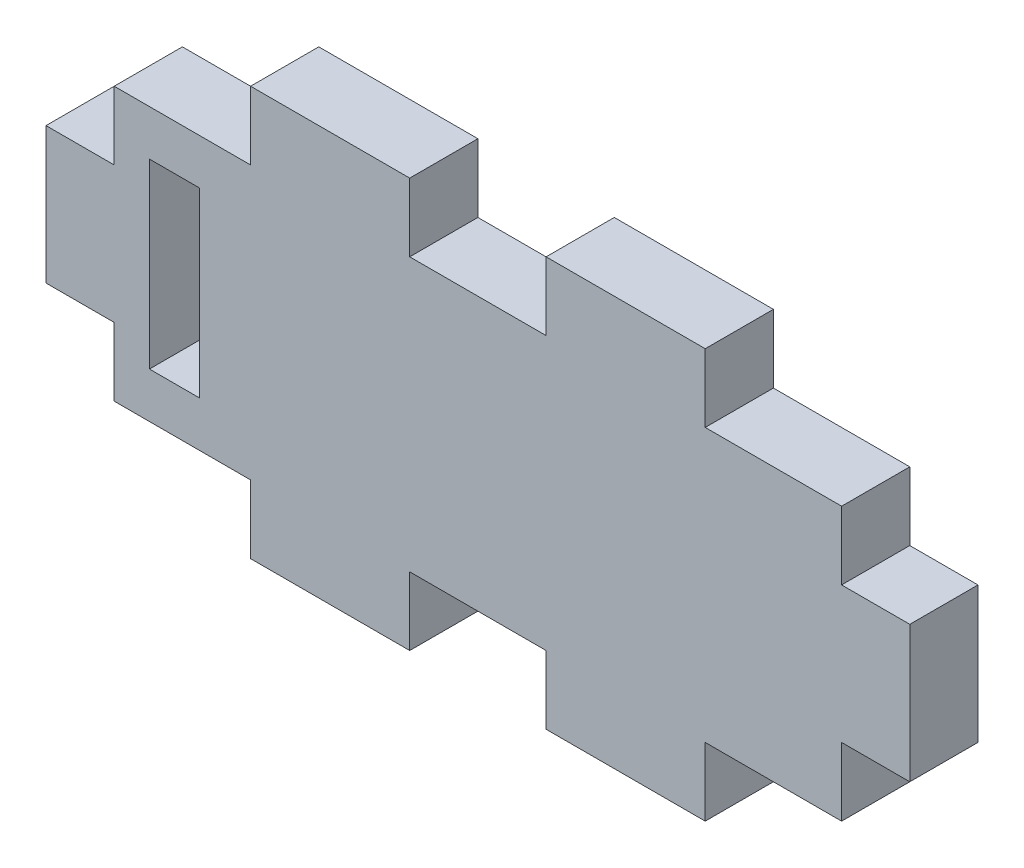
ISO-10303-21;
HEADER;
FILE_DESCRIPTION(('STEP AP214'),'2;1');
FILE_NAME('part.step','',(''),(''),'','','');
FILE_SCHEMA(('AUTOMOTIVE_DESIGN { 1 0 10303 214 1 1 1 1 }'));
ENDSEC;
DATA;
#1=APPLICATION_CONTEXT('core data for automotive mechanical design processes');
#2=APPLICATION_PROTOCOL_DEFINITION('international standard','automotive_design',2000,#1);
#3=PRODUCT_CONTEXT('',#1,'mechanical');
#4=PRODUCT('Part','Part','',(#3));
#5=PRODUCT_RELATED_PRODUCT_CATEGORY('part','',(#4));
#6=PRODUCT_DEFINITION_FORMATION('','',#4);
#7=PRODUCT_DEFINITION_CONTEXT('part definition',#1,'design');
#8=PRODUCT_DEFINITION('design','',#6,#7);
#9=PRODUCT_DEFINITION_SHAPE('','',#8);
#10=(LENGTH_UNIT() NAMED_UNIT(*) SI_UNIT(.MILLI.,.METRE.));
#11=(NAMED_UNIT(*) PLANE_ANGLE_UNIT() SI_UNIT($,.RADIAN.));
#12=(NAMED_UNIT(*) SI_UNIT($,.STERADIAN.) SOLID_ANGLE_UNIT());
#13=UNCERTAINTY_MEASURE_WITH_UNIT(LENGTH_MEASURE(1.E-05),#10,'distance_accuracy_value','');
#14=(GEOMETRIC_REPRESENTATION_CONTEXT(3) GLOBAL_UNCERTAINTY_ASSIGNED_CONTEXT((#13)) GLOBAL_UNIT_ASSIGNED_CONTEXT((#10,
#11,#12)) REPRESENTATION_CONTEXT('',''));
#15=CARTESIAN_POINT('',(0.,0.,0.));
#16=DIRECTION('',(0.,0.,1.));
#17=DIRECTION('',(1.,0.,0.));
#18=AXIS2_PLACEMENT_3D('',#15,#16,#17);
#19=CARTESIAN_POINT('',(-16.,6.,3.));
#20=DIRECTION('',(1.,0.,0.));
#21=DIRECTION('',(0.,1.,0.));
#22=AXIS2_PLACEMENT_3D('',#19,#20,#21);
#23=PLANE('',#22);
#24=DIRECTION('',(0.,0.,1.));
#25=VECTOR('',#24,1.);
#26=CARTESIAN_POINT('',(-16.,-3.,0.));
#27=LINE('',#26,#25);
#28=CARTESIAN_POINT('',(-16.,-3.,0.));
#29=VERTEX_POINT('',#28);
#30=CARTESIAN_POINT('',(-16.,-3.,3.));
#31=VERTEX_POINT('',#30);
#32=EDGE_CURVE('E424',#29,#31,#27,.T.);
#33=ORIENTED_EDGE('',*,*,#32,.F.);
#34=DIRECTION('',(0.,-1.,0.));
#35=VECTOR('',#34,1.);
#36=CARTESIAN_POINT('',(-16.,6.,0.));
#37=LINE('',#36,#35);
#38=CARTESIAN_POINT('',(-16.,-6.,0.));
#39=VERTEX_POINT('',#38);
#40=EDGE_CURVE('E509',#29,#39,#37,.T.);
#41=ORIENTED_EDGE('',*,*,#40,.T.);
#42=DIRECTION('',(0.,0.,-1.));
#43=VECTOR('',#42,1.);
#44=CARTESIAN_POINT('',(-16.,-6.,3.));
#45=LINE('',#44,#43);
#46=CARTESIAN_POINT('',(-16.,-6.,3.));
#47=VERTEX_POINT('',#46);
#48=EDGE_CURVE('E11',#47,#39,#45,.T.);
#49=ORIENTED_EDGE('',*,*,#48,.F.);
#50=DIRECTION('',(0.,-1.,0.));
#51=VECTOR('',#50,1.);
#52=CARTESIAN_POINT('',(-16.,6.,3.));
#53=LINE('',#52,#51);
#54=EDGE_CURVE('E524',#31,#47,#53,.T.);
#55=ORIENTED_EDGE('',*,*,#54,.F.);
#56=EDGE_LOOP('',(#33,#41,#49,#55));
#57=FACE_BOUND('',#56,.T.);
#58=ADVANCED_FACE('F44',(#57),#23,.F.);
#59=CARTESIAN_POINT('',(-16.,-6.,3.));
#60=DIRECTION('',(0.,1.,0.));
#61=DIRECTION('',(0.,0.,1.));
#62=AXIS2_PLACEMENT_3D('',#59,#60,#61);
#63=PLANE('',#62);
#64=DIRECTION('',(0.,0.,1.));
#65=VECTOR('',#64,1.);
#66=CARTESIAN_POINT('',(10.,-6.,0.));
#67=LINE('',#66,#65);
#68=CARTESIAN_POINT('',(10.,-6.,0.));
#69=VERTEX_POINT('',#68);
#70=CARTESIAN_POINT('',(10.,-6.,3.));
#71=VERTEX_POINT('',#70);
#72=EDGE_CURVE('E314',#69,#71,#67,.T.);
#73=ORIENTED_EDGE('',*,*,#72,.F.);
#74=DIRECTION('',(1.,0.,0.));
#75=VECTOR('',#74,1.);
#76=CARTESIAN_POINT('',(-16.,-6.,0.));
#77=LINE('',#76,#75);
#78=CARTESIAN_POINT('',(16.,-6.,0.));
#79=VERTEX_POINT('',#78);
#80=EDGE_CURVE('E546',#69,#79,#77,.T.);
#81=ORIENTED_EDGE('',*,*,#80,.T.);
#82=DIRECTION('',(0.,0.,-1.));
#83=VECTOR('',#82,1.);
#84=CARTESIAN_POINT('',(16.,-6.,3.));
#85=LINE('',#84,#83);
#86=CARTESIAN_POINT('',(16.,-6.,3.));
#87=VERTEX_POINT('',#86);
#88=EDGE_CURVE('E53',#87,#79,#85,.T.);
#89=ORIENTED_EDGE('',*,*,#88,.F.);
#90=DIRECTION('',(1.,0.,0.));
#91=VECTOR('',#90,1.);
#92=CARTESIAN_POINT('',(-16.,-6.,3.));
#93=LINE('',#92,#91);
#94=EDGE_CURVE('E523',#71,#87,#93,.T.);
#95=ORIENTED_EDGE('',*,*,#94,.F.);
#96=EDGE_LOOP('',(#73,#81,#89,#95));
#97=FACE_BOUND('',#96,.T.);
#98=ADVANCED_FACE('F611',(#97),#63,.F.);
#99=CARTESIAN_POINT('',(-3.,-6.,0.));
#100=VERTEX_POINT('',#99);
#101=CARTESIAN_POINT('',(3.,-6.,0.));
#102=VERTEX_POINT('',#101);
#103=EDGE_CURVE('E552',#100,#102,#77,.T.);
#104=ORIENTED_EDGE('',*,*,#103,.T.);
#105=DIRECTION('',(0.,0.,1.));
#106=VECTOR('',#105,1.);
#107=CARTESIAN_POINT('',(3.,-6.,0.));
#108=LINE('',#107,#106);
#109=CARTESIAN_POINT('',(3.,-6.,3.));
#110=VERTEX_POINT('',#109);
#111=EDGE_CURVE('E303',#102,#110,#108,.T.);
#112=ORIENTED_EDGE('',*,*,#111,.T.);
#113=CARTESIAN_POINT('',(-3.,-6.,3.));
#114=VERTEX_POINT('',#113);
#115=EDGE_CURVE('E530',#114,#110,#93,.T.);
#116=ORIENTED_EDGE('',*,*,#115,.F.);
#117=DIRECTION('',(0.,0.,1.));
#118=VECTOR('',#117,1.);
#119=CARTESIAN_POINT('',(-3.,-6.,0.));
#120=LINE('',#119,#118);
#121=EDGE_CURVE('E495',#100,#114,#120,.T.);
#122=ORIENTED_EDGE('',*,*,#121,.F.);
#123=EDGE_LOOP('',(#104,#112,#116,#122));
#124=FACE_BOUND('',#123,.T.);
#125=ADVANCED_FACE('F599',(#124),#63,.F.);
#126=CARTESIAN_POINT('',(16.,6.,3.));
#127=DIRECTION('',(-1.,0.,0.));
#128=DIRECTION('',(0.,0.,1.));
#129=AXIS2_PLACEMENT_3D('',#126,#127,#128);
#130=PLANE('',#129);
#131=DIRECTION('',(0.,0.,1.));
#132=VECTOR('',#131,1.);
#133=CARTESIAN_POINT('',(16.,3.,0.));
#134=LINE('',#133,#132);
#135=CARTESIAN_POINT('',(16.,3.,0.));
#136=VERTEX_POINT('',#135);
#137=CARTESIAN_POINT('',(16.,3.,3.));
#138=VERTEX_POINT('',#137);
#139=EDGE_CURVE('E449',#136,#138,#134,.T.);
#140=ORIENTED_EDGE('',*,*,#139,.F.);
#141=DIRECTION('',(0.,1.,0.));
#142=VECTOR('',#141,1.);
#143=CARTESIAN_POINT('',(16.,6.,0.));
#144=LINE('',#143,#142);
#145=CARTESIAN_POINT('',(16.,6.,0.));
#146=VERTEX_POINT('',#145);
#147=EDGE_CURVE('E551',#136,#146,#144,.T.);
#148=ORIENTED_EDGE('',*,*,#147,.T.);
#149=DIRECTION('',(0.,0.,-1.));
#150=VECTOR('',#149,1.);
#151=CARTESIAN_POINT('',(16.,6.,3.));
#152=LINE('',#151,#150);
#153=CARTESIAN_POINT('',(16.,6.,3.));
#154=VERTEX_POINT('',#153);
#155=EDGE_CURVE('E566',#154,#146,#152,.T.);
#156=ORIENTED_EDGE('',*,*,#155,.F.);
#157=DIRECTION('',(0.,1.,0.));
#158=VECTOR('',#157,1.);
#159=CARTESIAN_POINT('',(16.,6.,3.));
#160=LINE('',#159,#158);
#161=EDGE_CURVE('E529',#138,#154,#160,.T.);
#162=ORIENTED_EDGE('',*,*,#161,.F.);
#163=EDGE_LOOP('',(#140,#148,#156,#162));
#164=FACE_BOUND('',#163,.T.);
#165=ADVANCED_FACE('F701',(#164),#130,.F.);
#166=CARTESIAN_POINT('',(-16.,6.,3.));
#167=DIRECTION('',(0.,-1.,0.));
#168=DIRECTION('',(0.,0.,-1.));
#169=AXIS2_PLACEMENT_3D('',#166,#167,#168);
#170=PLANE('',#169);
#171=DIRECTION('',(0.,0.,1.));
#172=VECTOR('',#171,1.);
#173=CARTESIAN_POINT('',(-10.,6.,0.));
#174=LINE('',#173,#172);
#175=CARTESIAN_POINT('',(-10.,6.,0.));
#176=VERTEX_POINT('',#175);
#177=CARTESIAN_POINT('',(-10.,6.,3.));
#178=VERTEX_POINT('',#177);
#179=EDGE_CURVE('E388',#176,#178,#174,.T.);
#180=ORIENTED_EDGE('',*,*,#179,.F.);
#181=DIRECTION('',(-1.,0.,0.));
#182=VECTOR('',#181,1.);
#183=CARTESIAN_POINT('',(-16.,6.,0.));
#184=LINE('',#183,#182);
#185=CARTESIAN_POINT('',(-16.,6.,0.));
#186=VERTEX_POINT('',#185);
#187=EDGE_CURVE('E557',#176,#186,#184,.T.);
#188=ORIENTED_EDGE('',*,*,#187,.T.);
#189=DIRECTION('',(0.,0.,-1.));
#190=VECTOR('',#189,1.);
#191=CARTESIAN_POINT('',(-16.,6.,3.));
#192=LINE('',#191,#190);
#193=CARTESIAN_POINT('',(-16.,6.,3.));
#194=VERTEX_POINT('',#193);
#195=EDGE_CURVE('E540',#194,#186,#192,.T.);
#196=ORIENTED_EDGE('',*,*,#195,.F.);
#197=DIRECTION('',(-1.,0.,0.));
#198=VECTOR('',#197,1.);
#199=CARTESIAN_POINT('',(-16.,6.,3.));
#200=LINE('',#199,#198);
#201=EDGE_CURVE('E535',#178,#194,#200,.T.);
#202=ORIENTED_EDGE('',*,*,#201,.F.);
#203=EDGE_LOOP('',(#180,#188,#196,#202));
#204=FACE_BOUND('',#203,.T.);
#205=ADVANCED_FACE('F662',(#204),#170,.F.);
#206=CARTESIAN_POINT('',(3.,6.,0.));
#207=VERTEX_POINT('',#206);
#208=CARTESIAN_POINT('',(-3.,6.,0.));
#209=VERTEX_POINT('',#208);
#210=EDGE_CURVE('E562',#207,#209,#184,.T.);
#211=ORIENTED_EDGE('',*,*,#210,.T.);
#212=DIRECTION('',(0.,0.,1.));
#213=VECTOR('',#212,1.);
#214=CARTESIAN_POINT('',(-3.,6.,0.));
#215=LINE('',#214,#213);
#216=CARTESIAN_POINT('',(-3.,6.,3.));
#217=VERTEX_POINT('',#216);
#218=EDGE_CURVE('E377',#209,#217,#215,.T.);
#219=ORIENTED_EDGE('',*,*,#218,.T.);
#220=CARTESIAN_POINT('',(3.,6.,3.));
#221=VERTEX_POINT('',#220);
#222=EDGE_CURVE('E541',#221,#217,#200,.T.);
#223=ORIENTED_EDGE('',*,*,#222,.F.);
#224=DIRECTION('',(0.,0.,1.));
#225=VECTOR('',#224,1.);
#226=CARTESIAN_POINT('',(3.,6.,0.));
#227=LINE('',#226,#225);
#228=EDGE_CURVE('E341',#207,#221,#227,.T.);
#229=ORIENTED_EDGE('',*,*,#228,.F.);
#230=EDGE_LOOP('',(#211,#219,#223,#229));
#231=FACE_BOUND('',#230,.T.);
#232=ADVANCED_FACE('F656',(#231),#170,.F.);
#233=CARTESIAN_POINT('',(-16.,3.,0.));
#234=VERTEX_POINT('',#233);
#235=EDGE_CURVE('E542',#186,#234,#37,.T.);
#236=ORIENTED_EDGE('',*,*,#235,.T.);
#237=DIRECTION('',(0.,0.,1.));
#238=VECTOR('',#237,1.);
#239=CARTESIAN_POINT('',(-16.,3.,0.));
#240=LINE('',#239,#238);
#241=CARTESIAN_POINT('',(-16.,3.,3.));
#242=VERTEX_POINT('',#241);
#243=EDGE_CURVE('E413',#234,#242,#240,.T.);
#244=ORIENTED_EDGE('',*,*,#243,.T.);
#245=EDGE_CURVE('E519',#194,#242,#53,.T.);
#246=ORIENTED_EDGE('',*,*,#245,.F.);
#247=ORIENTED_EDGE('',*,*,#195,.T.);
#248=EDGE_LOOP('',(#236,#244,#246,#247));
#249=FACE_BOUND('',#248,.T.);
#250=ADVANCED_FACE('F46',(#249),#23,.F.);
#251=CARTESIAN_POINT('',(-10.,-6.,0.));
#252=VERTEX_POINT('',#251);
#253=EDGE_CURVE('E547',#39,#252,#77,.T.);
#254=ORIENTED_EDGE('',*,*,#253,.T.);
#255=DIRECTION('',(0.,0.,1.));
#256=VECTOR('',#255,1.);
#257=CARTESIAN_POINT('',(-10.,-6.,0.));
#258=LINE('',#257,#256);
#259=CARTESIAN_POINT('',(-10.,-6.,3.));
#260=VERTEX_POINT('',#259);
#261=EDGE_CURVE('E513',#252,#260,#258,.T.);
#262=ORIENTED_EDGE('',*,*,#261,.T.);
#263=EDGE_CURVE('E525',#47,#260,#93,.T.);
#264=ORIENTED_EDGE('',*,*,#263,.F.);
#265=ORIENTED_EDGE('',*,*,#48,.T.);
#266=EDGE_LOOP('',(#254,#262,#264,#265));
#267=FACE_BOUND('',#266,.T.);
#268=ADVANCED_FACE('F626',(#267),#63,.F.);
#269=CARTESIAN_POINT('',(16.,-3.,0.));
#270=VERTEX_POINT('',#269);
#271=EDGE_CURVE('E553',#79,#270,#144,.T.);
#272=ORIENTED_EDGE('',*,*,#271,.T.);
#273=DIRECTION('',(0.,0.,1.));
#274=VECTOR('',#273,1.);
#275=CARTESIAN_POINT('',(16.,-3.,0.));
#276=LINE('',#275,#274);
#277=CARTESIAN_POINT('',(16.,-3.,3.));
#278=VERTEX_POINT('',#277);
#279=EDGE_CURVE('E453',#270,#278,#276,.T.);
#280=ORIENTED_EDGE('',*,*,#279,.T.);
#281=EDGE_CURVE('E531',#87,#278,#160,.T.);
#282=ORIENTED_EDGE('',*,*,#281,.F.);
#283=ORIENTED_EDGE('',*,*,#88,.T.);
#284=EDGE_LOOP('',(#272,#280,#282,#283));
#285=FACE_BOUND('',#284,.T.);
#286=ADVANCED_FACE('F575',(#285),#130,.F.);
#287=CARTESIAN_POINT('',(10.,6.,0.));
#288=VERTEX_POINT('',#287);
#289=EDGE_CURVE('E558',#146,#288,#184,.T.);
#290=ORIENTED_EDGE('',*,*,#289,.T.);
#291=DIRECTION('',(0.,0.,1.));
#292=VECTOR('',#291,1.);
#293=CARTESIAN_POINT('',(10.,6.,0.));
#294=LINE('',#293,#292);
#295=CARTESIAN_POINT('',(10.,6.,3.));
#296=VERTEX_POINT('',#295);
#297=EDGE_CURVE('E345',#288,#296,#294,.T.);
#298=ORIENTED_EDGE('',*,*,#297,.T.);
#299=EDGE_CURVE('E536',#154,#296,#200,.T.);
#300=ORIENTED_EDGE('',*,*,#299,.F.);
#301=ORIENTED_EDGE('',*,*,#155,.T.);
#302=EDGE_LOOP('',(#290,#298,#300,#301));
#303=FACE_BOUND('',#302,.T.);
#304=ADVANCED_FACE('F665',(#303),#170,.F.);
#305=CARTESIAN_POINT('',(0.,0.,3.));
#306=DIRECTION('',(0.,0.,1.));
#307=DIRECTION('',(1.,0.,0.));
#308=AXIS2_PLACEMENT_3D('',#305,#306,#307);
#309=PLANE('',#308);
#310=DIRECTION('',(0.,1.,0.));
#311=VECTOR('',#310,1.);
#312=CARTESIAN_POINT('',(-12.25,4.,3.));
#313=LINE('',#312,#311);
#314=CARTESIAN_POINT('',(-12.25,-4.,3.));
#315=VERTEX_POINT('',#314);
#316=CARTESIAN_POINT('',(-12.25,4.,3.));
#317=VERTEX_POINT('',#316);
#318=EDGE_CURVE('E60',#315,#317,#313,.T.);
#319=ORIENTED_EDGE('',*,*,#318,.F.);
#320=DIRECTION('',(1.,0.,0.));
#321=VECTOR('',#320,1.);
#322=CARTESIAN_POINT('',(-12.25,-4.,3.));
#323=LINE('',#322,#321);
#324=CARTESIAN_POINT('',(-14.45,-4.,3.));
#325=VERTEX_POINT('',#324);
#326=EDGE_CURVE('E275',#325,#315,#323,.T.);
#327=ORIENTED_EDGE('',*,*,#326,.F.);
#328=DIRECTION('',(0.,-1.,0.));
#329=VECTOR('',#328,1.);
#330=CARTESIAN_POINT('',(-14.45,4.,3.));
#331=LINE('',#330,#329);
#332=CARTESIAN_POINT('',(-14.45,4.,3.));
#333=VERTEX_POINT('',#332);
#334=EDGE_CURVE('E279',#333,#325,#331,.T.);
#335=ORIENTED_EDGE('',*,*,#334,.F.);
#336=DIRECTION('',(-1.,0.,0.));
#337=VECTOR('',#336,1.);
#338=CARTESIAN_POINT('',(-12.25,4.,3.));
#339=LINE('',#338,#337);
#340=EDGE_CURVE('E288',#317,#333,#339,.T.);
#341=ORIENTED_EDGE('',*,*,#340,.F.);
#342=EDGE_LOOP('',(#319,#327,#335,#341));
#343=FACE_BOUND('',#342,.T.);
#344=ORIENTED_EDGE('',*,*,#245,.T.);
#345=DIRECTION('',(-1.,0.,0.));
#346=VECTOR('',#345,1.);
#347=CARTESIAN_POINT('',(-16.,3.,3.));
#348=LINE('',#347,#346);
#349=CARTESIAN_POINT('',(-19.,3.,3.));
#350=VERTEX_POINT('',#349);
#351=EDGE_CURVE('E391',#242,#350,#348,.T.);
#352=ORIENTED_EDGE('',*,*,#351,.T.);
#353=DIRECTION('',(0.,-1.,0.));
#354=VECTOR('',#353,1.);
#355=CARTESIAN_POINT('',(-19.,3.,3.));
#356=LINE('',#355,#354);
#357=CARTESIAN_POINT('',(-19.,-3.,3.));
#358=VERTEX_POINT('',#357);
#359=EDGE_CURVE('E432',#350,#358,#356,.T.);
#360=ORIENTED_EDGE('',*,*,#359,.T.);
#361=DIRECTION('',(1.,0.,0.));
#362=VECTOR('',#361,1.);
#363=CARTESIAN_POINT('',(-16.,-3.,3.));
#364=LINE('',#363,#362);
#365=EDGE_CURVE('E428',#358,#31,#364,.T.);
#366=ORIENTED_EDGE('',*,*,#365,.T.);
#367=ORIENTED_EDGE('',*,*,#54,.T.);
#368=ORIENTED_EDGE('',*,*,#263,.T.);
#369=DIRECTION('',(0.,-1.,0.));
#370=VECTOR('',#369,1.);
#371=CARTESIAN_POINT('',(-10.,-6.,3.));
#372=LINE('',#371,#370);
#373=CARTESIAN_POINT('',(-10.,-9.,3.));
#374=VERTEX_POINT('',#373);
#375=EDGE_CURVE('E499',#260,#374,#372,.T.);
#376=ORIENTED_EDGE('',*,*,#375,.T.);
#377=DIRECTION('',(1.,0.,0.));
#378=VECTOR('',#377,1.);
#379=CARTESIAN_POINT('',(-3.,-9.,3.));
#380=LINE('',#379,#378);
#381=CARTESIAN_POINT('',(-3.,-9.,3.));
#382=VERTEX_POINT('',#381);
#383=EDGE_CURVE('E487',#374,#382,#380,.T.);
#384=ORIENTED_EDGE('',*,*,#383,.T.);
#385=DIRECTION('',(0.,1.,0.));
#386=VECTOR('',#385,1.);
#387=CARTESIAN_POINT('',(-3.,-6.,3.));
#388=LINE('',#387,#386);
#389=EDGE_CURVE('E331',#382,#114,#388,.T.);
#390=ORIENTED_EDGE('',*,*,#389,.T.);
#391=ORIENTED_EDGE('',*,*,#115,.T.);
#392=DIRECTION('',(0.,-1.,0.));
#393=VECTOR('',#392,1.);
#394=CARTESIAN_POINT('',(3.,-6.,3.));
#395=LINE('',#394,#393);
#396=CARTESIAN_POINT('',(3.,-9.,3.));
#397=VERTEX_POINT('',#396);
#398=EDGE_CURVE('E327',#110,#397,#395,.T.);
#399=ORIENTED_EDGE('',*,*,#398,.T.);
#400=DIRECTION('',(1.,0.,0.));
#401=VECTOR('',#400,1.);
#402=CARTESIAN_POINT('',(3.,-9.,3.));
#403=LINE('',#402,#401);
#404=CARTESIAN_POINT('',(10.,-9.,3.));
#405=VERTEX_POINT('',#404);
#406=EDGE_CURVE('E322',#397,#405,#403,.T.);
#407=ORIENTED_EDGE('',*,*,#406,.T.);
#408=DIRECTION('',(0.,1.,0.));
#409=VECTOR('',#408,1.);
#410=CARTESIAN_POINT('',(10.,-6.,3.));
#411=LINE('',#410,#409);
#412=EDGE_CURVE('E318',#405,#71,#411,.T.);
#413=ORIENTED_EDGE('',*,*,#412,.T.);
#414=ORIENTED_EDGE('',*,*,#94,.T.);
#415=ORIENTED_EDGE('',*,*,#281,.T.);
#416=DIRECTION('',(1.,0.,0.));
#417=VECTOR('',#416,1.);
#418=CARTESIAN_POINT('',(16.,-3.,3.));
#419=LINE('',#418,#417);
#420=CARTESIAN_POINT('',(19.,-3.,3.));
#421=VERTEX_POINT('',#420);
#422=EDGE_CURVE('E466',#278,#421,#419,.T.);
#423=ORIENTED_EDGE('',*,*,#422,.T.);
#424=DIRECTION('',(0.,1.,0.));
#425=VECTOR('',#424,1.);
#426=CARTESIAN_POINT('',(19.,3.,3.));
#427=LINE('',#426,#425);
#428=CARTESIAN_POINT('',(19.,3.,3.));
#429=VERTEX_POINT('',#428);
#430=EDGE_CURVE('E462',#421,#429,#427,.T.);
#431=ORIENTED_EDGE('',*,*,#430,.T.);
#432=DIRECTION('',(-1.,0.,0.));
#433=VECTOR('',#432,1.);
#434=CARTESIAN_POINT('',(16.,3.,3.));
#435=LINE('',#434,#433);
#436=EDGE_CURVE('E427',#429,#138,#435,.T.);
#437=ORIENTED_EDGE('',*,*,#436,.T.);
#438=ORIENTED_EDGE('',*,*,#161,.T.);
#439=ORIENTED_EDGE('',*,*,#299,.T.);
#440=DIRECTION('',(0.,1.,0.));
#441=VECTOR('',#440,1.);
#442=CARTESIAN_POINT('',(10.,6.,3.));
#443=LINE('',#442,#441);
#444=CARTESIAN_POINT('',(10.,9.,3.));
#445=VERTEX_POINT('',#444);
#446=EDGE_CURVE('E360',#296,#445,#443,.T.);
#447=ORIENTED_EDGE('',*,*,#446,.T.);
#448=DIRECTION('',(-1.,0.,0.));
#449=VECTOR('',#448,1.);
#450=CARTESIAN_POINT('',(3.,9.,3.));
#451=LINE('',#450,#449);
#452=CARTESIAN_POINT('',(3.,9.,3.));
#453=VERTEX_POINT('',#452);
#454=EDGE_CURVE('E356',#445,#453,#451,.T.);
#455=ORIENTED_EDGE('',*,*,#454,.T.);
#456=DIRECTION('',(0.,-1.,0.));
#457=VECTOR('',#456,1.);
#458=CARTESIAN_POINT('',(3.,6.,3.));
#459=LINE('',#458,#457);
#460=EDGE_CURVE('E317',#453,#221,#459,.T.);
#461=ORIENTED_EDGE('',*,*,#460,.T.);
#462=ORIENTED_EDGE('',*,*,#222,.T.);
#463=DIRECTION('',(0.,1.,0.));
#464=VECTOR('',#463,1.);
#465=CARTESIAN_POINT('',(-3.,6.,3.));
#466=LINE('',#465,#464);
#467=CARTESIAN_POINT('',(-3.,9.,3.));
#468=VERTEX_POINT('',#467);
#469=EDGE_CURVE('E355',#217,#468,#466,.T.);
#470=ORIENTED_EDGE('',*,*,#469,.T.);
#471=DIRECTION('',(-1.,0.,0.));
#472=VECTOR('',#471,1.);
#473=CARTESIAN_POINT('',(-3.,9.,3.));
#474=LINE('',#473,#472);
#475=CARTESIAN_POINT('',(-10.,9.,3.));
#476=VERTEX_POINT('',#475);
#477=EDGE_CURVE('E396',#468,#476,#474,.T.);
#478=ORIENTED_EDGE('',*,*,#477,.T.);
#479=DIRECTION('',(0.,-1.,0.));
#480=VECTOR('',#479,1.);
#481=CARTESIAN_POINT('',(-10.,6.,3.));
#482=LINE('',#481,#480);
#483=EDGE_CURVE('E392',#476,#178,#482,.T.);
#484=ORIENTED_EDGE('',*,*,#483,.T.);
#485=ORIENTED_EDGE('',*,*,#201,.T.);
#486=EDGE_LOOP('',(#344,#352,#360,#366,#367,#368,#376,#384,#390,#391,#399,#407,#413,#414,#415,
#423,#431,#437,#438,#439,#447,#455,#461,#462,#470,#478,#484,#485));
#487=FACE_BOUND('',#486,.T.);
#488=ADVANCED_FACE('F587',(#343,#487),#309,.T.);
#489=CARTESIAN_POINT('',(0.,0.,0.));
#490=DIRECTION('',(0.,0.,1.));
#491=DIRECTION('',(1.,0.,0.));
#492=AXIS2_PLACEMENT_3D('',#489,#490,#491);
#493=PLANE('',#492);
#494=DIRECTION('',(1.,0.,0.));
#495=VECTOR('',#494,1.);
#496=CARTESIAN_POINT('',(-12.25,-4.,0.));
#497=LINE('',#496,#495);
#498=CARTESIAN_POINT('',(-14.45,-4.,0.));
#499=VERTEX_POINT('',#498);
#500=CARTESIAN_POINT('',(-12.25,-4.,0.));
#501=VERTEX_POINT('',#500);
#502=EDGE_CURVE('E263',#499,#501,#497,.T.);
#503=ORIENTED_EDGE('',*,*,#502,.T.);
#504=DIRECTION('',(0.,1.,0.));
#505=VECTOR('',#504,1.);
#506=CARTESIAN_POINT('',(-12.25,4.,0.));
#507=LINE('',#506,#505);
#508=CARTESIAN_POINT('',(-12.25,4.,0.));
#509=VERTEX_POINT('',#508);
#510=EDGE_CURVE('E256',#501,#509,#507,.T.);
#511=ORIENTED_EDGE('',*,*,#510,.T.);
#512=DIRECTION('',(-1.,0.,0.));
#513=VECTOR('',#512,1.);
#514=CARTESIAN_POINT('',(-12.25,4.,0.));
#515=LINE('',#514,#513);
#516=CARTESIAN_POINT('',(-14.45,4.,0.));
#517=VERTEX_POINT('',#516);
#518=EDGE_CURVE('E266',#509,#517,#515,.T.);
#519=ORIENTED_EDGE('',*,*,#518,.T.);
#520=DIRECTION('',(0.,-1.,0.));
#521=VECTOR('',#520,1.);
#522=CARTESIAN_POINT('',(-14.45,4.,0.));
#523=LINE('',#522,#521);
#524=EDGE_CURVE('E68',#517,#499,#523,.T.);
#525=ORIENTED_EDGE('',*,*,#524,.T.);
#526=EDGE_LOOP('',(#503,#511,#519,#525));
#527=FACE_BOUND('',#526,.T.);
#528=ORIENTED_EDGE('',*,*,#235,.F.);
#529=ORIENTED_EDGE('',*,*,#187,.F.);
#530=DIRECTION('',(0.,-1.,0.));
#531=VECTOR('',#530,1.);
#532=CARTESIAN_POINT('',(-10.,6.,0.));
#533=LINE('',#532,#531);
#534=CARTESIAN_POINT('',(-10.,9.,0.));
#535=VERTEX_POINT('',#534);
#536=EDGE_CURVE('E381',#535,#176,#533,.T.);
#537=ORIENTED_EDGE('',*,*,#536,.F.);
#538=DIRECTION('',(-1.,0.,0.));
#539=VECTOR('',#538,1.);
#540=CARTESIAN_POINT('',(-3.,9.,0.));
#541=LINE('',#540,#539);
#542=CARTESIAN_POINT('',(-3.,9.,0.));
#543=VERTEX_POINT('',#542);
#544=EDGE_CURVE('E406',#543,#535,#541,.T.);
#545=ORIENTED_EDGE('',*,*,#544,.F.);
#546=DIRECTION('',(0.,1.,0.));
#547=VECTOR('',#546,1.);
#548=CARTESIAN_POINT('',(-3.,6.,0.));
#549=LINE('',#548,#547);
#550=EDGE_CURVE('E397',#209,#543,#549,.T.);
#551=ORIENTED_EDGE('',*,*,#550,.F.);
#552=ORIENTED_EDGE('',*,*,#210,.F.);
#553=DIRECTION('',(0.,-1.,0.));
#554=VECTOR('',#553,1.);
#555=CARTESIAN_POINT('',(3.,6.,0.));
#556=LINE('',#555,#554);
#557=CARTESIAN_POINT('',(3.,9.,0.));
#558=VERTEX_POINT('',#557);
#559=EDGE_CURVE('E361',#558,#207,#556,.T.);
#560=ORIENTED_EDGE('',*,*,#559,.F.);
#561=DIRECTION('',(-1.,0.,0.));
#562=VECTOR('',#561,1.);
#563=CARTESIAN_POINT('',(3.,9.,0.));
#564=LINE('',#563,#562);
#565=CARTESIAN_POINT('',(10.,9.,0.));
#566=VERTEX_POINT('',#565);
#567=EDGE_CURVE('E344',#566,#558,#564,.T.);
#568=ORIENTED_EDGE('',*,*,#567,.F.);
#569=DIRECTION('',(0.,1.,0.));
#570=VECTOR('',#569,1.);
#571=CARTESIAN_POINT('',(10.,6.,0.));
#572=LINE('',#571,#570);
#573=EDGE_CURVE('E371',#288,#566,#572,.T.);
#574=ORIENTED_EDGE('',*,*,#573,.F.);
#575=ORIENTED_EDGE('',*,*,#289,.F.);
#576=ORIENTED_EDGE('',*,*,#147,.F.);
#577=DIRECTION('',(-1.,0.,0.));
#578=VECTOR('',#577,1.);
#579=CARTESIAN_POINT('',(16.,3.,0.));
#580=LINE('',#579,#578);
#581=CARTESIAN_POINT('',(19.,3.,0.));
#582=VERTEX_POINT('',#581);
#583=EDGE_CURVE('E467',#582,#136,#580,.T.);
#584=ORIENTED_EDGE('',*,*,#583,.F.);
#585=DIRECTION('',(0.,1.,0.));
#586=VECTOR('',#585,1.);
#587=CARTESIAN_POINT('',(19.,3.,0.));
#588=LINE('',#587,#586);
#589=CARTESIAN_POINT('',(19.,-3.,0.));
#590=VERTEX_POINT('',#589);
#591=EDGE_CURVE('E452',#590,#582,#588,.T.);
#592=ORIENTED_EDGE('',*,*,#591,.F.);
#593=DIRECTION('',(1.,0.,0.));
#594=VECTOR('',#593,1.);
#595=CARTESIAN_POINT('',(16.,-3.,0.));
#596=LINE('',#595,#594);
#597=EDGE_CURVE('E477',#270,#590,#596,.T.);
#598=ORIENTED_EDGE('',*,*,#597,.F.);
#599=ORIENTED_EDGE('',*,*,#271,.F.);
#600=ORIENTED_EDGE('',*,*,#80,.F.);
#601=DIRECTION('',(0.,1.,0.));
#602=VECTOR('',#601,1.);
#603=CARTESIAN_POINT('',(10.,-6.,0.));
#604=LINE('',#603,#602);
#605=CARTESIAN_POINT('',(10.,-9.,0.));
#606=VERTEX_POINT('',#605);
#607=EDGE_CURVE('E307',#606,#69,#604,.T.);
#608=ORIENTED_EDGE('',*,*,#607,.F.);
#609=DIRECTION('',(1.,0.,0.));
#610=VECTOR('',#609,1.);
#611=CARTESIAN_POINT('',(3.,-9.,0.));
#612=LINE('',#611,#610);
#613=CARTESIAN_POINT('',(3.,-9.,0.));
#614=VERTEX_POINT('',#613);
#615=EDGE_CURVE('E334',#614,#606,#612,.T.);
#616=ORIENTED_EDGE('',*,*,#615,.F.);
#617=DIRECTION('',(0.,-1.,0.));
#618=VECTOR('',#617,1.);
#619=CARTESIAN_POINT('',(3.,-6.,0.));
#620=LINE('',#619,#618);
#621=EDGE_CURVE('E323',#102,#614,#620,.T.);
#622=ORIENTED_EDGE('',*,*,#621,.F.);
#623=ORIENTED_EDGE('',*,*,#103,.F.);
#624=DIRECTION('',(0.,1.,0.));
#625=VECTOR('',#624,1.);
#626=CARTESIAN_POINT('',(-3.,-6.,0.));
#627=LINE('',#626,#625);
#628=CARTESIAN_POINT('',(-3.,-9.,0.));
#629=VERTEX_POINT('',#628);
#630=EDGE_CURVE('E483',#629,#100,#627,.T.);
#631=ORIENTED_EDGE('',*,*,#630,.F.);
#632=DIRECTION('',(1.,0.,0.));
#633=VECTOR('',#632,1.);
#634=CARTESIAN_POINT('',(-3.,-9.,0.));
#635=LINE('',#634,#633);
#636=CARTESIAN_POINT('',(-10.,-9.,0.));
#637=VERTEX_POINT('',#636);
#638=EDGE_CURVE('E491',#637,#629,#635,.T.);
#639=ORIENTED_EDGE('',*,*,#638,.F.);
#640=DIRECTION('',(0.,-1.,0.));
#641=VECTOR('',#640,1.);
#642=CARTESIAN_POINT('',(-10.,-6.,0.));
#643=LINE('',#642,#641);
#644=EDGE_CURVE('E486',#252,#637,#643,.T.);
#645=ORIENTED_EDGE('',*,*,#644,.F.);
#646=ORIENTED_EDGE('',*,*,#253,.F.);
#647=ORIENTED_EDGE('',*,*,#40,.F.);
#648=DIRECTION('',(1.,0.,0.));
#649=VECTOR('',#648,1.);
#650=CARTESIAN_POINT('',(-16.,-3.,0.));
#651=LINE('',#650,#649);
#652=CARTESIAN_POINT('',(-19.,-3.,0.));
#653=VERTEX_POINT('',#652);
#654=EDGE_CURVE('E417',#653,#29,#651,.T.);
#655=ORIENTED_EDGE('',*,*,#654,.F.);
#656=DIRECTION('',(0.,-1.,0.));
#657=VECTOR('',#656,1.);
#658=CARTESIAN_POINT('',(-19.,3.,0.));
#659=LINE('',#658,#657);
#660=CARTESIAN_POINT('',(-19.,3.,0.));
#661=VERTEX_POINT('',#660);
#662=EDGE_CURVE('E442',#661,#653,#659,.T.);
#663=ORIENTED_EDGE('',*,*,#662,.F.);
#664=DIRECTION('',(-1.,0.,0.));
#665=VECTOR('',#664,1.);
#666=CARTESIAN_POINT('',(-16.,3.,0.));
#667=LINE('',#666,#665);
#668=EDGE_CURVE('E433',#234,#661,#667,.T.);
#669=ORIENTED_EDGE('',*,*,#668,.F.);
#670=EDGE_LOOP('',(#528,#529,#537,#545,#551,#552,#560,#568,#574,#575,#576,#584,#592,#598,#599,
#600,#608,#616,#622,#623,#631,#639,#645,#646,#647,#655,#663,#669));
#671=FACE_BOUND('',#670,.T.);
#672=ADVANCED_FACE('F271',(#527,#671),#493,.F.);
#673=CARTESIAN_POINT('',(3.,6.,0.));
#674=DIRECTION('',(-1.,0.,0.));
#675=DIRECTION('',(0.,0.,1.));
#676=AXIS2_PLACEMENT_3D('',#673,#674,#675);
#677=PLANE('',#676);
#678=ORIENTED_EDGE('',*,*,#460,.F.);
#679=DIRECTION('',(0.,0.,1.));
#680=VECTOR('',#679,1.);
#681=CARTESIAN_POINT('',(3.,9.,0.));
#682=LINE('',#681,#680);
#683=EDGE_CURVE('E352',#558,#453,#682,.T.);
#684=ORIENTED_EDGE('',*,*,#683,.F.);
#685=ORIENTED_EDGE('',*,*,#559,.T.);
#686=ORIENTED_EDGE('',*,*,#228,.T.);
#687=EDGE_LOOP('',(#678,#684,#685,#686));
#688=FACE_BOUND('',#687,.T.);
#689=ADVANCED_FACE('F714',(#688),#677,.T.);
#690=CARTESIAN_POINT('',(3.,9.,0.));
#691=DIRECTION('',(0.,1.,0.));
#692=DIRECTION('',(0.,0.,1.));
#693=AXIS2_PLACEMENT_3D('',#690,#691,#692);
#694=PLANE('',#693);
#695=ORIENTED_EDGE('',*,*,#454,.F.);
#696=DIRECTION('',(0.,0.,1.));
#697=VECTOR('',#696,1.);
#698=CARTESIAN_POINT('',(10.,9.,0.));
#699=LINE('',#698,#697);
#700=EDGE_CURVE('E349',#566,#445,#699,.T.);
#701=ORIENTED_EDGE('',*,*,#700,.F.);
#702=ORIENTED_EDGE('',*,*,#567,.T.);
#703=ORIENTED_EDGE('',*,*,#683,.T.);
#704=EDGE_LOOP('',(#695,#701,#702,#703));
#705=FACE_BOUND('',#704,.T.);
#706=ADVANCED_FACE('F712',(#705),#694,.T.);
#707=CARTESIAN_POINT('',(10.,6.,0.));
#708=DIRECTION('',(1.,0.,0.));
#709=DIRECTION('',(0.,0.,-1.));
#710=AXIS2_PLACEMENT_3D('',#707,#708,#709);
#711=PLANE('',#710);
#712=ORIENTED_EDGE('',*,*,#446,.F.);
#713=ORIENTED_EDGE('',*,*,#297,.F.);
#714=ORIENTED_EDGE('',*,*,#573,.T.);
#715=ORIENTED_EDGE('',*,*,#700,.T.);
#716=EDGE_LOOP('',(#712,#713,#714,#715));
#717=FACE_BOUND('',#716,.T.);
#718=ADVANCED_FACE('F707',(#717),#711,.T.);
#719=CARTESIAN_POINT('',(-10.,6.,0.));
#720=DIRECTION('',(-1.,0.,0.));
#721=DIRECTION('',(0.,0.,1.));
#722=AXIS2_PLACEMENT_3D('',#719,#720,#721);
#723=PLANE('',#722);
#724=ORIENTED_EDGE('',*,*,#483,.F.);
#725=DIRECTION('',(0.,0.,1.));
#726=VECTOR('',#725,1.);
#727=CARTESIAN_POINT('',(-10.,9.,0.));
#728=LINE('',#727,#726);
#729=EDGE_CURVE('E385',#535,#476,#728,.T.);
#730=ORIENTED_EDGE('',*,*,#729,.F.);
#731=ORIENTED_EDGE('',*,*,#536,.T.);
#732=ORIENTED_EDGE('',*,*,#179,.T.);
#733=EDGE_LOOP('',(#724,#730,#731,#732));
#734=FACE_BOUND('',#733,.T.);
#735=ADVANCED_FACE('F681',(#734),#723,.T.);
#736=CARTESIAN_POINT('',(-3.,9.,0.));
#737=DIRECTION('',(0.,1.,0.));
#738=DIRECTION('',(0.,0.,1.));
#739=AXIS2_PLACEMENT_3D('',#736,#737,#738);
#740=PLANE('',#739);
#741=ORIENTED_EDGE('',*,*,#477,.F.);
#742=DIRECTION('',(0.,0.,1.));
#743=VECTOR('',#742,1.);
#744=CARTESIAN_POINT('',(-3.,9.,0.));
#745=LINE('',#744,#743);
#746=EDGE_CURVE('E382',#543,#468,#745,.T.);
#747=ORIENTED_EDGE('',*,*,#746,.F.);
#748=ORIENTED_EDGE('',*,*,#544,.T.);
#749=ORIENTED_EDGE('',*,*,#729,.T.);
#750=EDGE_LOOP('',(#741,#747,#748,#749));
#751=FACE_BOUND('',#750,.T.);
#752=ADVANCED_FACE('F732',(#751),#740,.T.);
#753=CARTESIAN_POINT('',(-3.,6.,0.));
#754=DIRECTION('',(1.,0.,0.));
#755=DIRECTION('',(0.,0.,-1.));
#756=AXIS2_PLACEMENT_3D('',#753,#754,#755);
#757=PLANE('',#756);
#758=ORIENTED_EDGE('',*,*,#469,.F.);
#759=ORIENTED_EDGE('',*,*,#218,.F.);
#760=ORIENTED_EDGE('',*,*,#550,.T.);
#761=ORIENTED_EDGE('',*,*,#746,.T.);
#762=EDGE_LOOP('',(#758,#759,#760,#761));
#763=FACE_BOUND('',#762,.T.);
#764=ADVANCED_FACE('F687',(#763),#757,.T.);
#765=CARTESIAN_POINT('',(16.,3.,0.));
#766=DIRECTION('',(0.,1.,0.));
#767=DIRECTION('',(-1.,0.,0.));
#768=AXIS2_PLACEMENT_3D('',#765,#766,#767);
#769=PLANE('',#768);
#770=ORIENTED_EDGE('',*,*,#436,.F.);
#771=DIRECTION('',(0.,0.,1.));
#772=VECTOR('',#771,1.);
#773=CARTESIAN_POINT('',(19.,3.,0.));
#774=LINE('',#773,#772);
#775=EDGE_CURVE('E297',#582,#429,#774,.T.);
#776=ORIENTED_EDGE('',*,*,#775,.F.);
#777=ORIENTED_EDGE('',*,*,#583,.T.);
#778=ORIENTED_EDGE('',*,*,#139,.T.);
#779=EDGE_LOOP('',(#770,#776,#777,#778));
#780=FACE_BOUND('',#779,.T.);
#781=ADVANCED_FACE('F731',(#780),#769,.T.);
#782=CARTESIAN_POINT('',(19.,3.,0.));
#783=DIRECTION('',(1.,0.,0.));
#784=DIRECTION('',(0.,0.,-1.));
#785=AXIS2_PLACEMENT_3D('',#782,#783,#784);
#786=PLANE('',#785);
#787=ORIENTED_EDGE('',*,*,#430,.F.);
#788=DIRECTION('',(0.,0.,1.));
#789=VECTOR('',#788,1.);
#790=CARTESIAN_POINT('',(19.,-3.,0.));
#791=LINE('',#790,#789);
#792=EDGE_CURVE('E457',#590,#421,#791,.T.);
#793=ORIENTED_EDGE('',*,*,#792,.F.);
#794=ORIENTED_EDGE('',*,*,#591,.T.);
#795=ORIENTED_EDGE('',*,*,#775,.T.);
#796=EDGE_LOOP('',(#787,#793,#794,#795));
#797=FACE_BOUND('',#796,.T.);
#798=ADVANCED_FACE('F647',(#797),#786,.T.);
#799=CARTESIAN_POINT('',(16.,-3.,0.));
#800=DIRECTION('',(0.,-1.,0.));
#801=DIRECTION('',(1.,0.,0.));
#802=AXIS2_PLACEMENT_3D('',#799,#800,#801);
#803=PLANE('',#802);
#804=ORIENTED_EDGE('',*,*,#422,.F.);
#805=ORIENTED_EDGE('',*,*,#279,.F.);
#806=ORIENTED_EDGE('',*,*,#597,.T.);
#807=ORIENTED_EDGE('',*,*,#792,.T.);
#808=EDGE_LOOP('',(#804,#805,#806,#807));
#809=FACE_BOUND('',#808,.T.);
#810=ADVANCED_FACE('F585',(#809),#803,.T.);
#811=CARTESIAN_POINT('',(-3.,-6.,0.));
#812=DIRECTION('',(1.,0.,0.));
#813=DIRECTION('',(0.,0.,-1.));
#814=AXIS2_PLACEMENT_3D('',#811,#812,#813);
#815=PLANE('',#814);
#816=ORIENTED_EDGE('',*,*,#389,.F.);
#817=DIRECTION('',(0.,0.,1.));
#818=VECTOR('',#817,1.);
#819=CARTESIAN_POINT('',(-3.,-9.,0.));
#820=LINE('',#819,#818);
#821=EDGE_CURVE('E506',#629,#382,#820,.T.);
#822=ORIENTED_EDGE('',*,*,#821,.F.);
#823=ORIENTED_EDGE('',*,*,#630,.T.);
#824=ORIENTED_EDGE('',*,*,#121,.T.);
#825=EDGE_LOOP('',(#816,#822,#823,#824));
#826=FACE_BOUND('',#825,.T.);
#827=ADVANCED_FACE('F639',(#826),#815,.T.);
#828=CARTESIAN_POINT('',(-3.,-9.,0.));
#829=DIRECTION('',(0.,-1.,0.));
#830=DIRECTION('',(0.,0.,-1.));
#831=AXIS2_PLACEMENT_3D('',#828,#829,#830);
#832=PLANE('',#831);
#833=ORIENTED_EDGE('',*,*,#383,.F.);
#834=DIRECTION('',(0.,0.,1.));
#835=VECTOR('',#834,1.);
#836=CARTESIAN_POINT('',(-10.,-9.,0.));
#837=LINE('',#836,#835);
#838=EDGE_CURVE('E510',#637,#374,#837,.T.);
#839=ORIENTED_EDGE('',*,*,#838,.F.);
#840=ORIENTED_EDGE('',*,*,#638,.T.);
#841=ORIENTED_EDGE('',*,*,#821,.T.);
#842=EDGE_LOOP('',(#833,#839,#840,#841));
#843=FACE_BOUND('',#842,.T.);
#844=ADVANCED_FACE('F637',(#843),#832,.T.);
#845=CARTESIAN_POINT('',(-10.,-6.,0.));
#846=DIRECTION('',(-1.,0.,0.));
#847=DIRECTION('',(0.,0.,1.));
#848=AXIS2_PLACEMENT_3D('',#845,#846,#847);
#849=PLANE('',#848);
#850=ORIENTED_EDGE('',*,*,#375,.F.);
#851=ORIENTED_EDGE('',*,*,#261,.F.);
#852=ORIENTED_EDGE('',*,*,#644,.T.);
#853=ORIENTED_EDGE('',*,*,#838,.T.);
#854=EDGE_LOOP('',(#850,#851,#852,#853));
#855=FACE_BOUND('',#854,.T.);
#856=ADVANCED_FACE('F634',(#855),#849,.T.);
#857=CARTESIAN_POINT('',(10.,-6.,0.));
#858=DIRECTION('',(1.,0.,0.));
#859=DIRECTION('',(0.,0.,-1.));
#860=AXIS2_PLACEMENT_3D('',#857,#858,#859);
#861=PLANE('',#860);
#862=ORIENTED_EDGE('',*,*,#412,.F.);
#863=DIRECTION('',(0.,0.,1.));
#864=VECTOR('',#863,1.);
#865=CARTESIAN_POINT('',(10.,-9.,0.));
#866=LINE('',#865,#864);
#867=EDGE_CURVE('E311',#606,#405,#866,.T.);
#868=ORIENTED_EDGE('',*,*,#867,.F.);
#869=ORIENTED_EDGE('',*,*,#607,.T.);
#870=ORIENTED_EDGE('',*,*,#72,.T.);
#871=EDGE_LOOP('',(#862,#868,#869,#870));
#872=FACE_BOUND('',#871,.T.);
#873=ADVANCED_FACE('F610',(#872),#861,.T.);
#874=CARTESIAN_POINT('',(3.,-9.,0.));
#875=DIRECTION('',(0.,-1.,0.));
#876=DIRECTION('',(0.,0.,-1.));
#877=AXIS2_PLACEMENT_3D('',#874,#875,#876);
#878=PLANE('',#877);
#879=ORIENTED_EDGE('',*,*,#406,.F.);
#880=DIRECTION('',(0.,0.,1.));
#881=VECTOR('',#880,1.);
#882=CARTESIAN_POINT('',(3.,-9.,0.));
#883=LINE('',#882,#881);
#884=EDGE_CURVE('E308',#614,#397,#883,.T.);
#885=ORIENTED_EDGE('',*,*,#884,.F.);
#886=ORIENTED_EDGE('',*,*,#615,.T.);
#887=ORIENTED_EDGE('',*,*,#867,.T.);
#888=EDGE_LOOP('',(#879,#885,#886,#887));
#889=FACE_BOUND('',#888,.T.);
#890=ADVANCED_FACE('F608',(#889),#878,.T.);
#891=CARTESIAN_POINT('',(3.,-6.,0.));
#892=DIRECTION('',(-1.,0.,0.));
#893=DIRECTION('',(0.,0.,1.));
#894=AXIS2_PLACEMENT_3D('',#891,#892,#893);
#895=PLANE('',#894);
#896=ORIENTED_EDGE('',*,*,#398,.F.);
#897=ORIENTED_EDGE('',*,*,#111,.F.);
#898=ORIENTED_EDGE('',*,*,#621,.T.);
#899=ORIENTED_EDGE('',*,*,#884,.T.);
#900=EDGE_LOOP('',(#896,#897,#898,#899));
#901=FACE_BOUND('',#900,.T.);
#902=ADVANCED_FACE('F603',(#901),#895,.T.);
#903=CARTESIAN_POINT('',(-16.,-3.,0.));
#904=DIRECTION('',(0.,-1.,0.));
#905=DIRECTION('',(1.,0.,0.));
#906=AXIS2_PLACEMENT_3D('',#903,#904,#905);
#907=PLANE('',#906);
#908=ORIENTED_EDGE('',*,*,#365,.F.);
#909=DIRECTION('',(0.,0.,1.));
#910=VECTOR('',#909,1.);
#911=CARTESIAN_POINT('',(-19.,-3.,0.));
#912=LINE('',#911,#910);
#913=EDGE_CURVE('E421',#653,#358,#912,.T.);
#914=ORIENTED_EDGE('',*,*,#913,.F.);
#915=ORIENTED_EDGE('',*,*,#654,.T.);
#916=ORIENTED_EDGE('',*,*,#32,.T.);
#917=EDGE_LOOP('',(#908,#914,#915,#916));
#918=FACE_BOUND('',#917,.T.);
#919=ADVANCED_FACE('F742',(#918),#907,.T.);
#920=CARTESIAN_POINT('',(-19.,3.,0.));
#921=DIRECTION('',(-1.,0.,0.));
#922=DIRECTION('',(0.,0.,1.));
#923=AXIS2_PLACEMENT_3D('',#920,#921,#922);
#924=PLANE('',#923);
#925=ORIENTED_EDGE('',*,*,#359,.F.);
#926=DIRECTION('',(0.,0.,1.));
#927=VECTOR('',#926,1.);
#928=CARTESIAN_POINT('',(-19.,3.,0.));
#929=LINE('',#928,#927);
#930=EDGE_CURVE('E418',#661,#350,#929,.T.);
#931=ORIENTED_EDGE('',*,*,#930,.F.);
#932=ORIENTED_EDGE('',*,*,#662,.T.);
#933=ORIENTED_EDGE('',*,*,#913,.T.);
#934=EDGE_LOOP('',(#925,#931,#932,#933));
#935=FACE_BOUND('',#934,.T.);
#936=ADVANCED_FACE('F739',(#935),#924,.T.);
#937=CARTESIAN_POINT('',(-16.,3.,0.));
#938=DIRECTION('',(0.,1.,0.));
#939=DIRECTION('',(-1.,0.,0.));
#940=AXIS2_PLACEMENT_3D('',#937,#938,#939);
#941=PLANE('',#940);
#942=ORIENTED_EDGE('',*,*,#351,.F.);
#943=ORIENTED_EDGE('',*,*,#243,.F.);
#944=ORIENTED_EDGE('',*,*,#668,.T.);
#945=ORIENTED_EDGE('',*,*,#930,.T.);
#946=EDGE_LOOP('',(#942,#943,#944,#945));
#947=FACE_BOUND('',#946,.T.);
#948=ADVANCED_FACE('F673',(#947),#941,.T.);
#949=CARTESIAN_POINT('',(-12.25,4.,0.));
#950=DIRECTION('',(1.,0.,0.));
#951=DIRECTION('',(0.,1.,0.));
#952=AXIS2_PLACEMENT_3D('',#949,#950,#951);
#953=PLANE('',#952);
#954=ORIENTED_EDGE('',*,*,#318,.T.);
#955=DIRECTION('',(0.,0.,1.));
#956=VECTOR('',#955,1.);
#957=CARTESIAN_POINT('',(-12.25,4.,0.));
#958=LINE('',#957,#956);
#959=EDGE_CURVE('E252',#509,#317,#958,.T.);
#960=ORIENTED_EDGE('',*,*,#959,.F.);
#961=ORIENTED_EDGE('',*,*,#510,.F.);
#962=DIRECTION('',(0.,0.,1.));
#963=VECTOR('',#962,1.);
#964=CARTESIAN_POINT('',(-12.25,-4.,0.));
#965=LINE('',#964,#963);
#966=EDGE_CURVE('E294',#501,#315,#965,.T.);
#967=ORIENTED_EDGE('',*,*,#966,.T.);
#968=EDGE_LOOP('',(#954,#960,#961,#967));
#969=FACE_BOUND('',#968,.T.);
#970=ADVANCED_FACE('F254',(#969),#953,.F.);
#971=CARTESIAN_POINT('',(-12.25,-4.,0.));
#972=DIRECTION('',(0.,-1.,0.));
#973=DIRECTION('',(0.,0.,-1.));
#974=AXIS2_PLACEMENT_3D('',#971,#972,#973);
#975=PLANE('',#974);
#976=ORIENTED_EDGE('',*,*,#326,.T.);
#977=ORIENTED_EDGE('',*,*,#966,.F.);
#978=ORIENTED_EDGE('',*,*,#502,.F.);
#979=DIRECTION('',(0.,0.,1.));
#980=VECTOR('',#979,1.);
#981=CARTESIAN_POINT('',(-14.45,-4.,0.));
#982=LINE('',#981,#980);
#983=EDGE_CURVE('E298',#499,#325,#982,.T.);
#984=ORIENTED_EDGE('',*,*,#983,.T.);
#985=EDGE_LOOP('',(#976,#977,#978,#984));
#986=FACE_BOUND('',#985,.T.);
#987=ADVANCED_FACE('F766',(#986),#975,.F.);
#988=CARTESIAN_POINT('',(-14.45,4.,0.));
#989=DIRECTION('',(-1.,0.,0.));
#990=DIRECTION('',(0.,-1.,0.));
#991=AXIS2_PLACEMENT_3D('',#988,#989,#990);
#992=PLANE('',#991);
#993=ORIENTED_EDGE('',*,*,#334,.T.);
#994=ORIENTED_EDGE('',*,*,#983,.F.);
#995=ORIENTED_EDGE('',*,*,#524,.F.);
#996=DIRECTION('',(0.,0.,1.));
#997=VECTOR('',#996,1.);
#998=CARTESIAN_POINT('',(-14.45,4.,0.));
#999=LINE('',#998,#997);
#1000=EDGE_CURVE('E262',#517,#333,#999,.T.);
#1001=ORIENTED_EDGE('',*,*,#1000,.T.);
#1002=EDGE_LOOP('',(#993,#994,#995,#1001));
#1003=FACE_BOUND('',#1002,.T.);
#1004=ADVANCED_FACE('F769',(#1003),#992,.F.);
#1005=CARTESIAN_POINT('',(-12.25,4.,0.));
#1006=DIRECTION('',(0.,1.,0.));
#1007=DIRECTION('',(0.,0.,1.));
#1008=AXIS2_PLACEMENT_3D('',#1005,#1006,#1007);
#1009=PLANE('',#1008);
#1010=ORIENTED_EDGE('',*,*,#340,.T.);
#1011=ORIENTED_EDGE('',*,*,#1000,.F.);
#1012=ORIENTED_EDGE('',*,*,#518,.F.);
#1013=ORIENTED_EDGE('',*,*,#959,.T.);
#1014=EDGE_LOOP('',(#1010,#1011,#1012,#1013));
#1015=FACE_BOUND('',#1014,.T.);
#1016=ADVANCED_FACE('F267',(#1015),#1009,.F.);
#1017=CLOSED_SHELL('',(#58,#98,#125,#165,#205,#232,#250,#268,#286,#304,#488,#672,#689,#706,#718,
#735,#752,#764,#781,#798,#810,#827,#844,#856,#873,#890,#902,#919,#936,#948,#970,#987,#1004,#1016));
#1018=MANIFOLD_SOLID_BREP('B2',#1017);
#1019=ADVANCED_BREP_SHAPE_REPRESENTATION('',(#18,#1018),#14);
#1020=SHAPE_DEFINITION_REPRESENTATION(#9,#1019);
ENDSEC;
END-ISO-10303-21;
